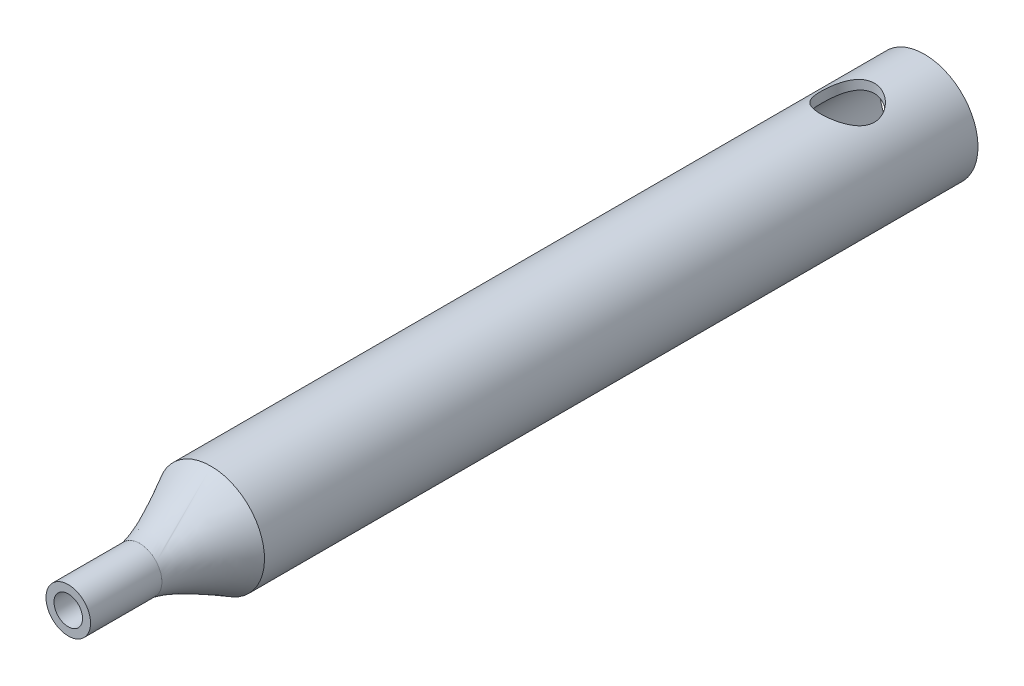
ISO-10303-21;
HEADER;
FILE_DESCRIPTION(('STEP AP214'),'2;1');
FILE_NAME('part.step','',(''),(''),'','','');
FILE_SCHEMA(('AUTOMOTIVE_DESIGN { 1 0 10303 214 1 1 1 1 }'));
ENDSEC;
DATA;
#1=APPLICATION_CONTEXT('core data for automotive mechanical design processes');
#2=APPLICATION_PROTOCOL_DEFINITION('international standard','automotive_design',2000,#1);
#3=PRODUCT_CONTEXT('',#1,'mechanical');
#4=PRODUCT('Part','Part','',(#3));
#5=PRODUCT_RELATED_PRODUCT_CATEGORY('part','',(#4));
#6=PRODUCT_DEFINITION_FORMATION('','',#4);
#7=PRODUCT_DEFINITION_CONTEXT('part definition',#1,'design');
#8=PRODUCT_DEFINITION('design','',#6,#7);
#9=PRODUCT_DEFINITION_SHAPE('','',#8);
#10=(LENGTH_UNIT() NAMED_UNIT(*) SI_UNIT(.MILLI.,.METRE.));
#11=(NAMED_UNIT(*) PLANE_ANGLE_UNIT() SI_UNIT($,.RADIAN.));
#12=(NAMED_UNIT(*) SI_UNIT($,.STERADIAN.) SOLID_ANGLE_UNIT());
#13=UNCERTAINTY_MEASURE_WITH_UNIT(LENGTH_MEASURE(1.E-05),#10,'distance_accuracy_value','');
#14=(GEOMETRIC_REPRESENTATION_CONTEXT(3) GLOBAL_UNCERTAINTY_ASSIGNED_CONTEXT((#13)) GLOBAL_UNIT_ASSIGNED_CONTEXT((#10,
#11,#12)) REPRESENTATION_CONTEXT('',''));
#15=CARTESIAN_POINT('',(0.,0.,0.));
#16=DIRECTION('',(0.,0.,1.));
#17=DIRECTION('',(1.,0.,0.));
#18=AXIS2_PLACEMENT_3D('',#15,#16,#17);
#19=CARTESIAN_POINT('',(0.,0.,400.));
#20=DIRECTION('',(0.,0.,-1.));
#21=DIRECTION('',(-1.,0.,0.));
#22=AXIS2_PLACEMENT_3D('',#19,#20,#21);
#23=CYLINDRICAL_SURFACE('',#22,30.);
#24=CARTESIAN_POINT('',(0.,0.,400.));
#25=DIRECTION('',(0.,0.,-1.));
#26=DIRECTION('',(-1.,0.,0.));
#27=AXIS2_PLACEMENT_3D('',#24,#25,#26);
#28=CIRCLE('',#27,30.);
#29=CARTESIAN_POINT('',(0.2073434643667,29.9992834695728,400.));
#30=VERTEX_POINT('',#29);
#31=EDGE_CURVE('E11',#30,#30,#28,.F.);
#32=ORIENTED_EDGE('',*,*,#31,.F.);
#33=EDGE_LOOP('',(#32));
#34=FACE_BOUND('',#33,.T.);
#35=CARTESIAN_POINT('',(0.,0.,0.));
#36=DIRECTION('',(0.,0.,1.));
#37=DIRECTION('',(1.,0.,0.));
#38=AXIS2_PLACEMENT_3D('',#35,#36,#37);
#39=CIRCLE('',#38,30.);
#40=CARTESIAN_POINT('',(30.,0.,0.));
#41=VERTEX_POINT('',#40);
#42=EDGE_CURVE('E55',#41,#41,#39,.T.);
#43=ORIENTED_EDGE('',*,*,#42,.T.);
#44=EDGE_LOOP('',(#43));
#45=FACE_BOUND('',#44,.T.);
#46=CARTESIAN_POINT('',(0.,30.,28.1148457236322));
#47=CARTESIAN_POINT('',(-0.394466621474774,29.999998801557,28.1148470268429));
#48=CARTESIAN_POINT('',(-0.788960822893599,29.9922016255587,28.1304239945336));
#49=CARTESIAN_POINT('',(-1.57504384672489,29.9612093031255,28.192554460937));
#50=CARTESIAN_POINT('',(-1.96663133023565,29.9380074580889,28.239121435436));
#51=CARTESIAN_POINT('',(-2.74444839066597,29.8767543344875,28.3627835892302));
#52=CARTESIAN_POINT('',(-3.13066783309048,29.8386781124095,28.4399300518542));
#53=CARTESIAN_POINT('',(-3.89427274204148,29.7486545172118,28.6238530448277));
#54=CARTESIAN_POINT('',(-4.27165908796738,29.6967085313725,28.7306266118593));
#55=CARTESIAN_POINT('',(-5.01370255233915,29.5804545351662,28.97219922689));
#56=CARTESIAN_POINT('',(-5.37840368544458,29.5161956713169,29.1068870248155));
#57=CARTESIAN_POINT('',(-6.09447648128182,29.3766988124944,29.4032622061584));
#58=CARTESIAN_POINT('',(-6.4458478568234,29.3014605811394,29.5649501708907));
#59=CARTESIAN_POINT('',(-7.1332709828304,29.1417386091232,29.9138995783717));
#60=CARTESIAN_POINT('',(-7.4693283295993,29.0572582848678,30.1011515774954));
#61=CARTESIAN_POINT('',(-8.12479620523716,28.8808404069853,30.4999761170425));
#62=CARTESIAN_POINT('',(-8.44420009848105,28.7888999175694,30.711558245867));
#63=CARTESIAN_POINT('',(-9.08356730455507,28.5938305145778,31.1711025687115));
#64=CARTESIAN_POINT('',(-9.40240338911198,28.4903612440417,31.4204890287629));
#65=CARTESIAN_POINT('',(-10.0182110858624,28.279698941058,31.9435134191064));
#66=CARTESIAN_POINT('',(-10.3151814463611,28.172505695949,32.2171527357709));
#67=CARTESIAN_POINT('',(-10.8860835918351,27.9568659465954,32.7874035914222));
#68=CARTESIAN_POINT('',(-11.1600008976787,27.8484187026569,33.0840293463725));
#69=CARTESIAN_POINT('',(-11.6833254232374,27.6329515274257,33.6987486541397));
#70=CARTESIAN_POINT('',(-11.9327280363632,27.5259318676454,34.0168462228843));
#71=CARTESIAN_POINT('',(-12.424066666325,27.3078803121426,34.6986355322757));
#72=CARTESIAN_POINT('',(-12.6639084928373,27.1971850469137,35.0639487923506));
#73=CARTESIAN_POINT('',(-13.1116371457317,26.98418857013,35.8157834668044));
#74=CARTESIAN_POINT('',(-13.319537514021,26.8818838099586,36.2022957987823));
#75=CARTESIAN_POINT('',(-13.7015816677248,26.6891822439467,36.9943945283428));
#76=CARTESIAN_POINT('',(-13.8757356708104,26.5987818363898,37.3999751061103));
#77=CARTESIAN_POINT('',(-14.1884178363296,26.4333149346089,38.2276746537374));
#78=CARTESIAN_POINT('',(-14.3269499463523,26.3582467414714,38.6497917850501));
#79=CARTESIAN_POINT('',(-14.5593818816456,26.2305343638818,39.4817182839713));
#80=CARTESIAN_POINT('',(-14.6554546162323,26.1768180083281,39.8907551067101));
#81=CARTESIAN_POINT('',(-14.8131483158836,26.0879066274182,40.717420421028));
#82=CARTESIAN_POINT('',(-14.874770754679,26.0527108097854,41.1350485442918));
#83=CARTESIAN_POINT('',(-14.9625716596024,26.0023849794443,41.9748676257909));
#84=CARTESIAN_POINT('',(-14.9887801055065,25.9872379945846,42.3970544192563));
#85=CARTESIAN_POINT('',(-15.0054120092055,25.9776389850629,43.2423494757854));
#86=CARTESIAN_POINT('',(-14.9958388811994,25.9831849859217,43.665457647083));
#87=CARTESIAN_POINT('',(-14.9443693637688,26.0128145300121,44.4580317685648));
#88=CARTESIAN_POINT('',(-14.9064815133301,26.0345983573782,44.8278532203756));
#89=CARTESIAN_POINT('',(-14.8036048078167,26.0932327004698,45.562459670151));
#90=CARTESIAN_POINT('',(-14.7386184959446,26.1300818023065,45.9272451374268));
#91=CARTESIAN_POINT('',(-14.5822778462236,26.2176501225825,46.6494958378915));
#92=CARTESIAN_POINT('',(-14.490916902454,26.2683728157028,47.0069592131016));
#93=CARTESIAN_POINT('',(-14.2827793732036,26.3821200845655,47.7123966938563));
#94=CARTESIAN_POINT('',(-14.1660014339124,26.4451453155715,48.0603702928263));
#95=CARTESIAN_POINT('',(-13.9051185945145,26.5832643427316,48.7529071091675));
#96=CARTESIAN_POINT('',(-13.7604466030275,26.6586025203762,49.0972075028954));
#97=CARTESIAN_POINT('',(-13.4467240006948,26.8182136501968,49.7724945365024));
#98=CARTESIAN_POINT('',(-13.2776646708395,26.902489795027,50.1034763603415));
#99=CARTESIAN_POINT('',(-12.9163207460711,27.0778318787809,50.7506852648304));
#100=CARTESIAN_POINT('',(-12.7240325037789,27.1688988831368,51.0669100175058));
#101=CARTESIAN_POINT('',(-12.3173373374606,27.3556808628563,51.6833684797858));
#102=CARTESIAN_POINT('',(-12.1029286391493,27.4513962107378,51.9836009037097));
#103=CARTESIAN_POINT('',(-11.6244221009995,27.6577118454254,52.6040592846877));
#104=CARTESIAN_POINT('',(-11.357472454083,27.7686577108201,52.9219759117663));
#105=CARTESIAN_POINT('',(-10.7983337273758,27.9908280513488,53.5344367839275));
#106=CARTESIAN_POINT('',(-10.5061534517949,28.1020524162508,53.8289891136798));
#107=CARTESIAN_POINT('',(-9.89761910582898,28.3221096552123,54.3935663017789));
#108=CARTESIAN_POINT('',(-9.58124396820907,28.4309403363792,54.6635693260845));
#109=CARTESIAN_POINT('',(-8.92619254193719,28.6433515457476,55.1770262515108));
#110=CARTESIAN_POINT('',(-8.58752523371367,28.7469341587371,55.4204907399945));
#111=CARTESIAN_POINT('',(-7.87309152384946,28.9509720492018,55.8900395211003));
#112=CARTESIAN_POINT('',(-7.49633062281164,29.0510540383704,56.1147769925092));
#113=CARTESIAN_POINT('',(-6.72229496746224,29.2398602306793,56.5313995790577));
#114=CARTESIAN_POINT('',(-6.32501925897373,29.3285839048568,56.7232831643152));
#115=CARTESIAN_POINT('',(-5.51289034160744,29.4920238478019,57.0720371782021));
#116=CARTESIAN_POINT('',(-5.09804850978522,29.5667490178724,57.2289298688538));
#117=CARTESIAN_POINT('',(-4.25373396764104,29.6999715301343,57.5059218921032));
#118=CARTESIAN_POINT('',(-3.82426294674312,29.7584707390643,57.6260254573236));
#119=CARTESIAN_POINT('',(-2.99040123124789,29.8532869753576,57.8194445154115));
#120=CARTESIAN_POINT('',(-2.58687987737183,29.8910400620817,57.8958115883602));
#121=CARTESIAN_POINT('',(-1.77375891598894,29.9502903820135,58.0152684604805));
#122=CARTESIAN_POINT('',(-1.36415964033065,29.9717884994209,58.0583600696954));
#123=CARTESIAN_POINT('',(-0.542432179601612,29.997911413823,58.1106852059221));
#124=CARTESIAN_POINT('',(-0.130305071717028,30.0025429572167,58.1199322702964));
#125=CARTESIAN_POINT('',(0.693142933067784,29.994817097575,58.104478938015));
#126=CARTESIAN_POINT('',(1.10446386484085,29.9824604464011,58.0797800437355));
#127=CARTESIAN_POINT('',(1.89104365716467,29.9427257003129,58.0000026454495));
#128=CARTESIAN_POINT('',(2.26662317638415,29.9165882159642,57.9474314160769));
#129=CARTESIAN_POINT('',(3.01155508953995,29.8508011715185,57.8142906791921));
#130=CARTESIAN_POINT('',(3.38090788254089,29.8111524808224,57.7337229731533));
#131=CARTESIAN_POINT('',(4.11102643115709,29.7192676443939,57.545424927818));
#132=CARTESIAN_POINT('',(4.47179170797617,29.6670307986078,57.4376930778512));
#133=CARTESIAN_POINT('',(5.18257720416892,29.5511518897374,57.1961030183818));
#134=CARTESIAN_POINT('',(5.53259697135358,29.4875093474508,57.0622437111314));
#135=CARTESIAN_POINT('',(6.22979935488013,29.3482462177938,56.7653850958304));
#136=CARTESIAN_POINT('',(6.57661612017299,29.272335697607,56.6016633753395));
#137=CARTESIAN_POINT('',(7.25508680349726,29.1116003998498,56.2491473991004));
#138=CARTESIAN_POINT('',(7.5867405882688,29.0267755439573,56.0603529230571));
#139=CARTESIAN_POINT('',(8.23341158684488,28.8500141492428,55.6589988822308));
#140=CARTESIAN_POINT('',(8.54842613296241,28.7580764758464,55.4464355236254));
#141=CARTESIAN_POINT('',(9.16054648853284,28.5689877148343,54.9987940908105));
#142=CARTESIAN_POINT('',(9.45764526147814,28.4718346067851,54.7637072630389));
#143=CARTESIAN_POINT('',(10.060839107335,28.264658535799,54.2482172249215));
#144=CARTESIAN_POINT('',(10.3649587307601,28.1543078560172,53.9656308422517));
#145=CARTESIAN_POINT('',(10.9485707923032,27.9325307005895,53.3764612091946));
#146=CARTESIAN_POINT('',(11.2280621358616,27.8211041773737,53.0698768934048));
#147=CARTESIAN_POINT('',(11.761157874002,27.5999727101685,52.4340399180621));
#148=CARTESIAN_POINT('',(12.0147464980315,27.4902688489899,52.104773650727));
#149=CARTESIAN_POINT('',(12.4944228999317,27.2756020510062,51.4252245980899));
#150=CARTESIAN_POINT('',(12.7205059505332,27.1706399310878,51.0749382155517));
#151=CARTESIAN_POINT('',(13.1539172060939,26.9635854627915,50.33746178314));
#152=CARTESIAN_POINT('',(13.3597919511091,26.8618830625115,49.9493050322685));
#153=CARTESIAN_POINT('',(13.737567232961,26.6706596125161,49.1541242296155));
#154=CARTESIAN_POINT('',(13.9094843147169,26.5811326373223,48.7471094857962));
#155=CARTESIAN_POINT('',(14.2174151642657,26.4177119317274,47.917021374547));
#156=CARTESIAN_POINT('',(14.353457663537,26.343805700354,47.493961170254));
#157=CARTESIAN_POINT('',(14.5879514095295,26.2146840125195,46.6347707815674));
#158=CARTESIAN_POINT('',(14.6864084766722,26.1594656622327,46.198642632146));
#159=CARTESIAN_POINT('',(14.8366134509912,26.0745391304287,45.3595585560246));
#160=CARTESIAN_POINT('',(14.8919378625023,26.0428909694122,44.9574370989508));
#161=CARTESIAN_POINT('',(14.9698153891526,25.9982052216003,44.1490047273543));
#162=CARTESIAN_POINT('',(14.9923707330054,25.9851663691362,43.7426940996416));
#163=CARTESIAN_POINT('',(15.0043645010929,25.9782426346808,42.9295753721242));
#164=CARTESIAN_POINT('',(14.9938151743778,25.9843506681547,42.5227675119811));
#165=CARTESIAN_POINT('',(14.9397884815991,26.0154509876885,41.7120875589525));
#166=CARTESIAN_POINT('',(14.8963124635393,26.0404425006674,41.3082153465664));
#167=CARTESIAN_POINT('',(14.782795841076,26.1050327210138,40.5451740411916));
#168=CARTESIAN_POINT('',(14.7156934571528,26.1430058498993,40.185423678914));
#169=CARTESIAN_POINT('',(14.5558242789108,26.2323533322958,39.4732519078369));
#170=CARTESIAN_POINT('',(14.4630489945772,26.2837321187293,39.1208329650582));
#171=CARTESIAN_POINT('',(14.2527724980854,26.398348288616,38.4254492436286));
#172=CARTESIAN_POINT('',(14.1352709916016,26.4615858132274,38.0824845775704));
#173=CARTESIAN_POINT('',(13.8765585244577,26.5981673635335,37.4076814068152));
#174=CARTESIAN_POINT('',(13.7353452308956,26.6715123835342,37.0758440007397));
#175=CARTESIAN_POINT('',(13.4200195538922,26.8316304555799,36.4028966664141));
#176=CARTESIAN_POINT('',(13.2443351386714,26.9189743770845,36.0626593862493));
#177=CARTESIAN_POINT('',(12.8684192321828,27.1006892572676,35.3980084247445));
#178=CARTESIAN_POINT('',(12.6681869929773,27.195060430022,35.0735952259631));
#179=CARTESIAN_POINT('',(12.2442855818538,27.3885333524453,34.441769724755));
#180=CARTESIAN_POINT('',(12.0206075892618,27.4876368748118,34.1343638877058));
#181=CARTESIAN_POINT('',(11.5509819278367,27.6882651807261,33.5378447656913));
#182=CARTESIAN_POINT('',(11.3050309237573,27.7897903252146,33.2487342313826));
#183=CARTESIAN_POINT('',(10.7607009160988,28.0054119834236,32.6559576192445));
#184=CARTESIAN_POINT('',(10.4595848725634,28.1195336241787,32.3548073137436));
#185=CARTESIAN_POINT('',(9.83237263592984,28.3449371560153,31.7788107156571));
#186=CARTESIAN_POINT('',(9.50628425805798,28.4562199211215,31.5039562537241));
#187=CARTESIAN_POINT('',(8.8304006449509,28.673159445471,30.981978396187));
#188=CARTESIAN_POINT('',(8.48058689086185,28.778811692232,30.7348770723123));
#189=CARTESIAN_POINT('',(7.75934315416604,28.9815957867285,30.2705270285275));
#190=CARTESIAN_POINT('',(7.38791441884538,29.0787281252935,30.0532765885076));
#191=CARTESIAN_POINT('',(6.62283359834587,29.2625004136629,29.6490902817848));
#192=CARTESIAN_POINT('',(6.22904153096555,29.3490603255149,29.4623824161632));
#193=CARTESIAN_POINT('',(5.42422205013372,29.5084068974344,29.1231152844107));
#194=CARTESIAN_POINT('',(5.01319217734312,29.581191583951,28.9705609108149));
#195=CARTESIAN_POINT('',(4.17809175418139,29.7106316368391,28.7018144701986));
#196=CARTESIAN_POINT('',(3.75405665560563,29.7673271650683,28.5855317882122));
#197=CARTESIAN_POINT('',(2.89570983328149,29.8630393092051,28.3904315921045));
#198=CARTESIAN_POINT('',(2.46140455781256,29.9020667236411,28.3115911922829));
#199=CARTESIAN_POINT('',(1.68912528485809,29.9542914994303,28.2064223677277));
#200=CARTESIAN_POINT('',(1.35247752005867,29.9714022130442,28.1721105239883));
#201=CARTESIAN_POINT('',(0.67722664728,29.9942571345872,28.1263213274479));
#202=CARTESIAN_POINT('',(0.338623485589112,30.000001028784,28.1148446049121));
#203=CARTESIAN_POINT('',(0.,30.,28.1148457236322));
#204=B_SPLINE_CURVE_WITH_KNOTS('',3,(#46,#47,#48,#49,#50,#51,#52,#53,#54,#55,#56,#57,#58,#59,
#60,#61,#62,#63,#64,#65,#66,#67,#68,#69,#70,#71,#72,#73,#74,#75,#76,#77,#78,#79,#80,#81,#82,#83,
#84,#85,#86,#87,#88,#89,#90,#91,#92,#93,#94,#95,#96,#97,#98,#99,#100,#101,#102,#103,#104,#105,
#106,#107,#108,#109,#110,#111,#112,#113,#114,#115,#116,#117,#118,#119,#120,#121,#122,#123,#124,
#125,#126,#127,#128,#129,#130,#131,#132,#133,#134,#135,#136,#137,#138,#139,#140,#141,#142,#143,
#144,#145,#146,#147,#148,#149,#150,#151,#152,#153,#154,#155,#156,#157,#158,#159,#160,#161,#162,
#163,#164,#165,#166,#167,#168,#169,#170,#171,#172,#173,#174,#175,#176,#177,#178,#179,#180,#181,
#182,#183,#184,#185,#186,#187,#188,#189,#190,#191,#192,#193,#194,#195,#196,#197,#198,#199,#200,
#201,#202,#203),.UNSPECIFIED.,.T.,.F.,(4,2,2,2,2,2,2,2,2,2,2,2,2,2,2,2,2,2,2,2,2,2,2,2,2,2,2,2,
2,2,2,2,2,2,2,2,2,2,2,2,2,2,2,2,2,2,2,2,2,2,2,2,2,2,2,2,2,2,2,2,2,2,2,2,2,2,2,2,2,2,2,2,2,2,2,2,
2,2,4),(0.,1.1830658838765,2.36664655205927,3.5522205995842,4.73767610811697,5.91849492154762,
7.09933916134023,8.27974835920213,9.46062435602729,10.7126941080732,11.9648354787242,
13.2177575130875,14.4709145374423,15.821667201721,17.1718456109054,18.5216145742371,
19.8712338927467,21.1401798733571,22.4090715662491,23.6768884023223,24.9445842691984,
26.0604534443427,27.1762179182402,28.2922620948529,29.4083657309785,30.5501573825651,
31.6923582661888,32.8347387306653,33.9772108970053,35.2649000045823,36.5521415758273,
37.8405170382692,39.1283766165387,40.4765138704575,41.824713885002,43.1720536807209,
44.519238405488,45.7548292237563,46.9903528264139,48.2253821822107,49.4603568799793,
50.5994583371909,51.7384865108584,52.8775780428886,54.0167174442702,55.188356729037,
56.3600063087792,57.53184316668,58.7041373111916,59.9914055352965,61.2787309408958,
62.5668355046821,63.8551611378706,65.2063513889893,66.5568816778176,67.9063270370394,
69.2555633384069,70.4752824018563,71.6949185050053,72.9141033841498,74.1332383531127,
75.2357784731186,76.3386836391977,77.4416019343193,78.5446288045349,79.7216927437009,
80.8987925552604,82.0763368112874,83.2540576898124,84.5752168212047,85.895964165236,
87.217754555028,88.5394687467831,89.8706389488176,91.2019997209938,92.5300073067729,
93.8572021316087,94.872757858524,95.8883416150965),.UNSPECIFIED.);
#205=CARTESIAN_POINT('',(0.,30.,28.1148457236322));
#206=VERTEX_POINT('',#205);
#207=EDGE_CURVE('E110',#206,#206,#204,.T.);
#208=ORIENTED_EDGE('',*,*,#207,.F.);
#209=EDGE_LOOP('',(#208));
#210=FACE_BOUND('',#209,.T.);
#211=ADVANCED_FACE('F41',(#34,#45,#210),#23,.T.);
#212=CARTESIAN_POINT('',(0.,0.,400.));
#213=DIRECTION('',(0.,0.,-1.));
#214=DIRECTION('',(-1.,0.,0.));
#215=AXIS2_PLACEMENT_3D('',#212,#213,#214);
#216=CYLINDRICAL_SURFACE('',#215,25.);
#217=CARTESIAN_POINT('',(0.,0.,0.));
#218=DIRECTION('',(0.,0.,1.));
#219=DIRECTION('',(1.,0.,0.));
#220=AXIS2_PLACEMENT_3D('',#217,#218,#219);
#221=CIRCLE('',#220,25.);
#222=CARTESIAN_POINT('',(25.,0.,0.));
#223=VERTEX_POINT('',#222);
#224=EDGE_CURVE('E61',#223,#223,#221,.T.);
#225=ORIENTED_EDGE('',*,*,#224,.F.);
#226=EDGE_LOOP('',(#225));
#227=FACE_BOUND('',#226,.T.);
#228=CARTESIAN_POINT('',(0.,0.,400.));
#229=DIRECTION('',(0.,0.,1.));
#230=DIRECTION('',(1.,0.,0.));
#231=AXIS2_PLACEMENT_3D('',#228,#229,#230);
#232=CIRCLE('',#231,25.);
#233=CARTESIAN_POINT('',(15.2480972776865,-19.8114999283298,400.));
#234=VERTEX_POINT('',#233);
#235=EDGE_CURVE('E71',#234,#234,#232,.T.);
#236=ORIENTED_EDGE('',*,*,#235,.T.);
#237=EDGE_LOOP('',(#236));
#238=FACE_BOUND('',#237,.T.);
#239=CARTESIAN_POINT('',(0.,25.,28.1148457236322));
#240=CARTESIAN_POINT('',(-0.383843598201931,24.9999970861597,28.1148488505363));
#241=CARTESIAN_POINT('',(-0.767784254040576,24.991137438834,28.1296022767921));
#242=CARTESIAN_POINT('',(-1.53276887263417,24.9559090750233,28.1884283098888));
#243=CARTESIAN_POINT('',(-1.91381100849754,24.9295301138906,28.2325180715633));
#244=CARTESIAN_POINT('',(-2.67072508911214,24.8598465581404,28.349542283133));
#245=CARTESIAN_POINT('',(-3.0465839447191,24.816505173134,28.4225394353765));
#246=CARTESIAN_POINT('',(-3.78950828651222,24.7139687091223,28.5964032538961));
#247=CARTESIAN_POINT('',(-4.15657496199743,24.6547757876649,28.6972661274363));
#248=CARTESIAN_POINT('',(-4.87779877599095,24.5222523283562,28.9250819516064));
#249=CARTESIAN_POINT('',(-5.23201108142516,24.4489936333394,29.0519025283318));
#250=CARTESIAN_POINT('',(-5.92746529298513,24.2897598083599,29.3305971924712));
#251=CARTESIAN_POINT('',(-6.26870680533959,24.2037842927231,29.4824720397442));
#252=CARTESIAN_POINT('',(-6.93642888935361,24.0209437141628,29.8098032117945));
#253=CARTESIAN_POINT('',(-7.2629157388265,23.9240833448709,29.9852493787731));
#254=CARTESIAN_POINT('',(-7.89998904730598,23.7213395040689,30.3584165247094));
#255=CARTESIAN_POINT('',(-8.21057359815958,23.6154549537696,30.5561401677241));
#256=CARTESIAN_POINT('',(-8.83781905465296,23.3882992480134,30.9884729110151));
#257=CARTESIAN_POINT('',(-9.1531312214518,23.2664706017758,31.2247459717985));
#258=CARTESIAN_POINT('',(-9.7629213752563,23.0172517437796,31.7201230762963));
#259=CARTESIAN_POINT('',(-10.057398454286,22.8898612900329,31.9792281139057));
#260=CARTESIAN_POINT('',(-10.6248831675776,22.6320370342775,32.5193053535624));
#261=CARTESIAN_POINT('',(-10.8978641157463,22.5015997022108,32.8003039006003));
#262=CARTESIAN_POINT('',(-11.4210121902915,22.2406371711999,33.3827479171198));
#263=CARTESIAN_POINT('',(-11.671178827851,22.1101119704335,33.6841938244632));
#264=CARTESIAN_POINT('',(-12.1769914408693,21.8360582425371,34.3447534147307));
#265=CARTESIAN_POINT('',(-12.4295387034086,21.6929009005901,34.70640320681));
#266=CARTESIAN_POINT('',(-12.9030726391603,21.4146251545039,35.4528556834754));
#267=CARTESIAN_POINT('',(-13.1240540998314,21.279508080219,35.8376621771098));
#268=CARTESIAN_POINT('',(-13.5322641506391,21.0222731752269,36.6282834976769));
#269=CARTESIAN_POINT('',(-13.7195368165732,20.9001384563758,37.034069984839));
#270=CARTESIAN_POINT('',(-14.0584554713944,20.6736891809441,37.864992858006));
#271=CARTESIAN_POINT('',(-14.2101147555573,20.5693679781584,38.2901219519986));
#272=CARTESIAN_POINT('',(-14.443430354607,20.4059403493866,39.0521457875738));
#273=CARTESIAN_POINT('',(-14.5331472679521,20.3419988147078,39.3855543539075));
#274=CARTESIAN_POINT('',(-14.6897511158531,20.2292004538863,40.0601699590992));
#275=CARTESIAN_POINT('',(-14.7566431317938,20.1803402704946,40.4013752441445));
#276=CARTESIAN_POINT('',(-14.8666742572357,20.0994197441264,41.0892163931486));
#277=CARTESIAN_POINT('',(-14.9098377634727,20.0673421475889,41.4358463010529));
#278=CARTESIAN_POINT('',(-14.9718816218246,20.0210956696035,42.1324833560694));
#279=CARTESIAN_POINT('',(-14.9907615559489,20.0069270964218,42.4824905612101));
#280=CARTESIAN_POINT('',(-15.0039499265836,19.9970387456714,43.1839216060078));
#281=CARTESIAN_POINT('',(-14.9982099161591,20.0013553430504,43.5353468780422));
#282=CARTESIAN_POINT('',(-14.9621411232559,20.0283506968187,44.2362153793603));
#283=CARTESIAN_POINT('',(-14.9318122213057,20.0510295424255,44.5856585990055));
#284=CARTESIAN_POINT('',(-14.8470086291074,20.1139032813397,45.2802161259529));
#285=CARTESIAN_POINT('',(-14.7925183964389,20.1541094492836,45.6253274994956));
#286=CARTESIAN_POINT('',(-14.6601590013996,20.2505906994963,46.3087301789985));
#287=CARTESIAN_POINT('',(-14.5822892988101,20.3068661530693,46.647021327174));
#288=CARTESIAN_POINT('',(-14.4053154515478,20.4327800596766,47.3104635478657));
#289=CARTESIAN_POINT('',(-14.3065063553846,20.5022315596226,47.6357293389353));
#290=CARTESIAN_POINT('',(-14.0880247918821,20.6529698240816,48.2764515066761));
#291=CARTESIAN_POINT('',(-13.9683455042383,20.7342604561453,48.5919046367696));
#292=CARTESIAN_POINT('',(-13.7091228330125,20.9065578167818,49.2117984936566));
#293=CARTESIAN_POINT('',(-13.5695782545621,20.9975651297165,49.5162385566476));
#294=CARTESIAN_POINT('',(-13.2715474690814,21.1871947948246,50.1132278846028));
#295=CARTESIAN_POINT('',(-13.1130602851057,21.285817539663,50.4057765352361));
#296=CARTESIAN_POINT('',(-12.7486253866408,21.5064058540751,51.0284071529114));
#297=CARTESIAN_POINT('',(-12.5392260080174,21.6294357356237,51.3560960542063));
#298=CARTESIAN_POINT('',(-12.0966278114806,21.8800426177679,51.9930202251659));
#299=CARTESIAN_POINT('',(-11.8634327560062,22.0076188974429,52.3022583999405));
#300=CARTESIAN_POINT('',(-11.3739770929309,22.264525658336,52.9016994003209));
#301=CARTESIAN_POINT('',(-11.1176939142337,22.3938577488344,53.1918831084818));
#302=CARTESIAN_POINT('',(-10.5831847951293,22.6513624553686,53.7518582383822));
#303=CARTESIAN_POINT('',(-10.3049576243925,22.7795350059429,54.0216485150639));
#304=CARTESIAN_POINT('',(-9.68713352998387,23.0496938210152,54.5758594781597));
#305=CARTESIAN_POINT('',(-9.34439126214339,23.1911109861692,54.8570658298433));
#306=CARTESIAN_POINT('',(-8.63303424111083,23.4652087602107,55.3895399128676));
#307=CARTESIAN_POINT('',(-8.2644167615809,23.5978884456118,55.64080448185));
#308=CARTESIAN_POINT('',(-7.50325185662638,23.8508273067756,56.1110464825741));
#309=CARTESIAN_POINT('',(-7.11071324127699,23.9710910118615,56.3300357008492));
#310=CARTESIAN_POINT('',(-6.30389449388674,24.195788680839,56.7333714661788));
#311=CARTESIAN_POINT('',(-5.88961706850805,24.3002246091541,56.9177223129671));
#312=CARTESIAN_POINT('',(-5.06893197868009,24.4841063656874,57.238856241309));
#313=CARTESIAN_POINT('',(-4.66367129451915,24.564711665597,57.3779035839603));
#314=CARTESIAN_POINT('',(-3.83961804513013,24.7069238908804,57.6214606179495));
#315=CARTESIAN_POINT('',(-3.42082586865653,24.7685313615191,57.7259713005454));
#316=CARTESIAN_POINT('',(-2.573734229538,24.8708204616488,57.8987069543663));
#317=CARTESIAN_POINT('',(-2.14544468851985,24.9115229464216,57.9669680912674));
#318=CARTESIAN_POINT('',(-1.28306575999734,24.9707917165063,58.0661680583382));
#319=CARTESIAN_POINT('',(-0.848977196916332,24.9893611152255,58.0971121378149));
#320=CARTESIAN_POINT('',(-0.038557159901996,25.0027956625433,58.1195056839899));
#321=CARTESIAN_POINT('',(0.337604459154143,25.0005398661068,58.1157519713316));
#322=CARTESIAN_POINT('',(1.08807434287322,24.9791304005495,58.0800443272745));
#323=CARTESIAN_POINT('',(1.46238280559599,24.9599785782216,58.0480934779182));
#324=CARTESIAN_POINT('',(2.20633983442916,24.9052445158509,57.9564275104621));
#325=CARTESIAN_POINT('',(2.57598854049865,24.8696627705063,57.8967132283072));
#326=CARTESIAN_POINT('',(3.30803230029226,24.7829131822675,57.7502911272702));
#327=CARTESIAN_POINT('',(3.67042717367751,24.7317449523865,57.6635826381651));
#328=CARTESIAN_POINT('',(4.37685523301615,24.616419378412,57.466650795785));
#329=CARTESIAN_POINT('',(4.72112071492132,24.5526100445156,57.3570539249897));
#330=CARTESIAN_POINT('',(5.39860860100539,24.4125926873419,57.1142925476446));
#331=CARTESIAN_POINT('',(5.73183134124647,24.3363850417986,56.9811287590869));
#332=CARTESIAN_POINT('',(6.38567322040939,24.1730581959947,56.6924341937696));
#333=CARTESIAN_POINT('',(6.70629164180511,24.0859383757151,56.5369021459931));
#334=CARTESIAN_POINT('',(7.33362517640251,23.9024012053276,56.2046873046993));
#335=CARTESIAN_POINT('',(7.64033861236355,23.8059827379661,56.0280019689489));
#336=CARTESIAN_POINT('',(8.26980517998059,23.5951606294873,55.6353023153606));
#337=CARTESIAN_POINT('',(8.59092272944407,23.4799288054403,55.4171095677272));
#338=CARTESIAN_POINT('',(9.21369198185215,23.2426106694795,54.9578856669367));
#339=CARTESIAN_POINT('',(9.51534255354477,23.1205239599888,54.7168531885379));
#340=CARTESIAN_POINT('',(10.0984876356475,22.8718413348671,54.2130071012508));
#341=CARTESIAN_POINT('',(10.3799603037873,22.7452407484749,53.9501705341543));
#342=CARTESIAN_POINT('',(10.9214919932809,22.490233495056,53.4041068271018));
#343=CARTESIAN_POINT('',(11.1815501111138,22.3618267520915,53.120878827736));
#344=CARTESIAN_POINT('',(11.711842411274,22.0892014122374,52.4968267682514));
#345=CARTESIAN_POINT('',(11.9789793522584,21.9451050516921,52.1533088375537));
#346=CARTESIAN_POINT('',(12.4833594208291,21.6621647753414,51.4428440154141));
#347=CARTESIAN_POINT('',(12.7205977369527,21.523321707436,51.0758933673209));
#348=CARTESIAN_POINT('',(13.1633137600036,21.2554478593413,50.3203113823736));
#349=CARTESIAN_POINT('',(13.3688175501278,21.1264090656337,49.9316982118001));
#350=CARTESIAN_POINT('',(13.7463221620137,20.8827470598031,49.1342387326095));
#351=CARTESIAN_POINT('',(13.9183331635795,20.7681194713009,48.7253986193009));
#352=CARTESIAN_POINT('',(14.1933907541535,20.5807934083521,47.9799890005114));
#353=CARTESIAN_POINT('',(14.3033087605131,20.5043856706989,47.6468750900422));
#354=CARTESIAN_POINT('',(14.5001155308505,20.3656858868337,46.9710670161488));
#355=CARTESIAN_POINT('',(14.5870093260325,20.3033907571952,46.6283749638444));
#356=CARTESIAN_POINT('',(14.7366422105018,20.1950469968589,45.9356247136367));
#357=CARTESIAN_POINT('',(14.7994087863437,20.1489798836817,45.5855753799702));
#358=CARTESIAN_POINT('',(14.9000384338231,20.0746802537378,44.8800144155328));
#359=CARTESIAN_POINT('',(14.9379013600587,20.0464478411006,44.5245027528819));
#360=CARTESIAN_POINT('',(14.9882188418345,20.0088555504116,43.8093111813494));
#361=CARTESIAN_POINT('',(15.000575965109,19.9995680435521,43.4496205477374));
#362=CARTESIAN_POINT('',(14.9993827596147,20.0004629136012,42.730306304954));
#363=CARTESIAN_POINT('',(14.9858323853129,20.0106453247287,42.3706826959015));
#364=CARTESIAN_POINT('',(14.9330399600131,20.0500720623985,41.6542235859616));
#365=CARTESIAN_POINT('',(14.8937856905246,20.0793254544093,41.2973894927597));
#366=CARTESIAN_POINT('',(14.7901958992563,20.1557492567276,40.5893493899461));
#367=CARTESIAN_POINT('',(14.7258602739107,20.2029197410183,40.23814340358));
#368=CARTESIAN_POINT('',(14.5767391025224,20.3107531861942,39.5605322277726));
#369=CARTESIAN_POINT('',(14.4930978422934,20.3706500394351,39.2337507172681));
#370=CARTESIAN_POINT('',(14.3048374038112,20.503289403388,38.5888648067041));
#371=CARTESIAN_POINT('',(14.2002114321044,20.5760360731037,38.2707632546218));
#372=CARTESIAN_POINT('',(13.9709549384207,20.7323817775245,37.6445990663022));
#373=CARTESIAN_POINT('',(13.8463230372323,20.8159815603686,37.3365371239597));
#374=CARTESIAN_POINT('',(13.577991485859,20.9919958236309,36.7314532523131));
#375=CARTESIAN_POINT('',(13.4342910062629,21.0844106874226,36.4344318039486));
#376=CARTESIAN_POINT('',(13.1052044073709,21.2907700846095,35.8074888691056));
#377=CARTESIAN_POINT('',(12.9168055284846,21.4058416967628,35.4795176230742));
#378=CARTESIAN_POINT('',(12.5169261183886,21.642100118335,34.840261991569));
#379=CARTESIAN_POINT('',(12.3054428698542,21.7632876467706,34.5289795770282));
#380=CARTESIAN_POINT('',(11.8602581653327,22.0090654256467,33.923791621405));
#381=CARTESIAN_POINT('',(11.6265414946063,22.1336579640345,33.6298982062746));
#382=CARTESIAN_POINT('',(11.1379037923633,22.3835300736241,33.0606010678569));
#383=CARTESIAN_POINT('',(10.8829814131332,22.5088096880192,32.7851985217567));
#384=CARTESIAN_POINT('',(10.3093956231846,22.7778929374613,32.2103949980804));
#385=CARTESIAN_POINT('',(9.98712444962473,22.9213771055024,31.9144298704844));
#386=CARTESIAN_POINT('',(9.31630351045608,23.2021274121993,31.350556723638));
#387=CARTESIAN_POINT('',(8.96775055984757,23.3393927939842,31.082652114376));
#388=CARTESIAN_POINT('',(8.24572196159848,23.6041516372397,30.5768060459735));
#389=CARTESIAN_POINT('',(7.87223408279992,23.7316402361083,30.3388794594251));
#390=CARTESIAN_POINT('',(7.10241008285,23.9732864709495,29.8954271642669));
#391=CARTESIAN_POINT('',(6.7060768311224,24.0874457756816,29.6898973986106));
#392=CARTESIAN_POINT('',(5.90535485537675,24.2959393450001,29.3193609420573));
#393=CARTESIAN_POINT('',(5.50158081631707,24.3907721979159,29.1533092275007));
#394=CARTESIAN_POINT('',(4.67750151978478,24.5621264167291,28.8560653756812));
#395=CARTESIAN_POINT('',(4.25719351622463,24.638644725728,28.7248790574331));
#396=CARTESIAN_POINT('',(3.40501595177152,24.7707728782358,28.4998033733401));
#397=CARTESIAN_POINT('',(2.97318944063261,24.8264513407411,28.4057915449188));
#398=CARTESIAN_POINT('',(2.10091679412847,24.9154168023929,28.2561227402211));
#399=CARTESIAN_POINT('',(1.66047815319875,24.9487224499678,28.200433819675));
#400=CARTESIAN_POINT('',(1.01562005124393,24.9801864376456,28.14788729234));
#401=CARTESIAN_POINT('',(0.812782174910464,24.9876101393964,28.1355032830096));
#402=CARTESIAN_POINT('',(0.406638621564437,24.9975177780224,28.1189815274251));
#403=CARTESIAN_POINT('',(0.20333292856946,25.0000015435445,28.1148440672217));
#404=CARTESIAN_POINT('',(0.,25.,28.1148457236322));
#405=B_SPLINE_CURVE_WITH_KNOTS('',3,(#239,#240,#241,#242,#243,#244,#245,#246,#247,#248,#249,
#250,#251,#252,#253,#254,#255,#256,#257,#258,#259,#260,#261,#262,#263,#264,#265,#266,#267,#268,
#269,#270,#271,#272,#273,#274,#275,#276,#277,#278,#279,#280,#281,#282,#283,#284,#285,#286,#287,
#288,#289,#290,#291,#292,#293,#294,#295,#296,#297,#298,#299,#300,#301,#302,#303,#304,#305,#306,
#307,#308,#309,#310,#311,#312,#313,#314,#315,#316,#317,#318,#319,#320,#321,#322,#323,#324,#325,
#326,#327,#328,#329,#330,#331,#332,#333,#334,#335,#336,#337,#338,#339,#340,#341,#342,#343,#344,
#345,#346,#347,#348,#349,#350,#351,#352,#353,#354,#355,#356,#357,#358,#359,#360,#361,#362,#363,
#364,#365,#366,#367,#368,#369,#370,#371,#372,#373,#374,#375,#376,#377,#378,#379,#380,#381,#382,
#383,#384,#385,#386,#387,#388,#389,#390,#391,#392,#393,#394,#395,#396,#397,#398,#399,#400,#401,
#402,#403,#404),.UNSPECIFIED.,.T.,.F.,(4,2,2,2,2,2,2,2,2,2,2,2,2,2,2,2,2,2,2,2,2,2,2,2,2,2,2,2,
2,2,2,2,2,2,2,2,2,2,2,2,2,2,2,2,2,2,2,2,2,2,2,2,2,2,2,2,2,2,2,2,2,2,2,2,2,2,2,2,2,2,2,2,2,2,2,2,
2,2,2,2,2,2,4),(0.,1.15131650286521,2.30330684658597,3.45780975393181,4.612155602032,
5.76075519873301,6.90938963716679,8.05753066262214,9.20580913480962,10.4418189333315,
11.677882563005,12.9154572581261,14.1530584631589,15.5426172518037,16.9324052372309,
18.3203625971641,19.7078009747203,20.7601695949573,21.8123037789111,22.8633541662871,
23.9144226450402,24.9675603560417,26.0207031840108,27.0745244592484,28.1283700865276,
29.1682513024588,30.2084729869153,31.2487572656591,32.2890952191643,33.5115258926161,
34.7337635807986,35.9572093784948,37.1807238197138,38.5750211979187,39.9694657072174,
41.3633997151926,42.757160576736,44.063161425012,45.3691247856981,46.6737827450107,
47.9782571595934,49.1054114040663,50.2324424620235,51.3594395877587,52.4864646972628,
53.5859458393993,54.6853934903978,55.7849036392925,56.8845460618251,58.0982352119811,
59.3119948278363,60.5270490774492,61.7421545662941,63.1157547067805,64.4895756135914,
65.8622612715279,67.2345290616493,68.310502748735,69.3862411219535,70.4607503192203,
71.5352657900453,72.6138783741586,73.6924928539611,74.7716204317745,75.8507524655585,
76.8775008650291,77.9045821954032,78.9317343633339,79.9589312231551,81.143836327243,
82.3288810604908,83.5147426565242,84.7006796768088,86.080471860688,87.4604315264943,
88.8410731397027,90.2215417178829,91.5598929838274,92.8984674797594,94.2325948699265,
95.5656088394694,96.1754729545425,96.785358223789),.UNSPECIFIED.);
#406=CARTESIAN_POINT('',(0.,25.,28.1148457236322));
#407=VERTEX_POINT('',#406);
#408=EDGE_CURVE('E45',#407,#407,#405,.T.);
#409=ORIENTED_EDGE('',*,*,#408,.T.);
#410=EDGE_LOOP('',(#409));
#411=FACE_BOUND('',#410,.T.);
#412=ADVANCED_FACE('F77',(#227,#238,#411),#216,.F.);
#413=CARTESIAN_POINT('',(0.,0.,0.));
#414=DIRECTION('',(0.,0.,1.));
#415=DIRECTION('',(1.,0.,0.));
#416=AXIS2_PLACEMENT_3D('',#413,#414,#415);
#417=PLANE('',#416);
#418=ORIENTED_EDGE('',*,*,#42,.F.);
#419=EDGE_LOOP('',(#418));
#420=FACE_BOUND('',#419,.T.);
#421=ORIENTED_EDGE('',*,*,#224,.T.);
#422=EDGE_LOOP('',(#421));
#423=FACE_BOUND('',#422,.T.);
#424=ADVANCED_FACE('F86',(#420,#423),#417,.F.);
#425=CARTESIAN_POINT('',(0.2073434643667,29.9992834695728,400.));
#426=CARTESIAN_POINT('',(9.38158045045876,8.2605053266474,440.));
#427=CARTESIAN_POINT('',(-59.7912234747789,30.4139703983062,400.));
#428=CARTESIAN_POINT('',(-7.13943020283603,27.0236662275649,440.));
#429=CARTESIAN_POINT('',(-60.2059104035123,-29.5845965408394,400.));
#430=CARTESIAN_POINT('',(-25.9025911037536,10.5026555742701,440.));
#431=CARTESIAN_POINT('',(-0.207343464366697,-29.9992834695728,400.));
#432=CARTESIAN_POINT('',(-9.38158045045876,-8.2605053266474,440.));
#433=CARTESIAN_POINT('',(59.7912234747789,-30.4139703983062,400.));
#434=CARTESIAN_POINT('',(7.13943020283603,-27.0236662275649,440.));
#435=CARTESIAN_POINT('',(60.2059104035123,29.5845965408394,400.));
#436=CARTESIAN_POINT('',(25.9025911037536,-10.5026555742701,440.));
#437=CARTESIAN_POINT('',(0.2073434643667,29.9992834695728,400.));
#438=CARTESIAN_POINT('',(9.38158045045876,8.2605053266474,440.));
#439=(BOUNDED_SURFACE() B_SPLINE_SURFACE(3,1,((#425,#426),(#427,#428),(#429,#430),(#431,#432),
(#433,#434),(#435,#436),(#437,#438)),.UNSPECIFIED.,.T.,.F.,.F.) B_SPLINE_SURFACE_WITH_KNOTS((4,
3,4),(2,2),(0.,0.5,1.),(0.,1.),
.UNSPECIFIED.) GEOMETRIC_REPRESENTATION_ITEM() RATIONAL_B_SPLINE_SURFACE(((1.,1.),
(0.333333333333333,0.333333333333333),(0.333333333333333,0.333333333333333),(1.,1.),
(0.333333333333333,0.333333333333333),(0.333333333333333,0.333333333333333),(1.,1.))) REPRESENTATION_ITEM('') SURFACE());
#440=CARTESIAN_POINT('',(0.,0.,440.));
#441=DIRECTION('',(0.,0.,1.));
#442=DIRECTION('',(1.,0.,0.));
#443=AXIS2_PLACEMENT_3D('',#440,#441,#442);
#444=CIRCLE('',#443,12.5);
#445=CARTESIAN_POINT('',(9.38158045045876,8.2605053266474,440.));
#446=VERTEX_POINT('',#445);
#447=EDGE_CURVE('E150',#446,#446,#444,.T.);
#448=CARTESIAN_POINT('',(0.2073434643667,29.9992834695728,400.));
#449=CARTESIAN_POINT('',(0.302908432971828,29.7728378639173,400.416666666667));
#450=CARTESIAN_POINT('',(0.398473401576953,29.5463922582619,400.833333333333));
#451=CARTESIAN_POINT('',(0.589603338787203,29.0935010469509,401.666666666667));
#452=CARTESIAN_POINT('',(0.685168307392328,28.8670554412954,402.083333333333));
#453=CARTESIAN_POINT('',(0.876298244602579,28.4141642299845,402.916666666667));
#454=CARTESIAN_POINT('',(0.971863213207703,28.187718624329,403.333333333333));
#455=CARTESIAN_POINT('',(1.16299315041795,27.7348274130181,404.166666666667));
#456=CARTESIAN_POINT('',(1.25855811902308,27.5083818073626,404.583333333333));
#457=CARTESIAN_POINT('',(1.44968805623333,27.0554905960517,405.416666666667));
#458=CARTESIAN_POINT('',(1.54525302483846,26.8290449903962,405.833333333333));
#459=CARTESIAN_POINT('',(1.73638296204871,26.3761537790852,406.666666666667));
#460=CARTESIAN_POINT('',(1.83194793065383,26.1497081734298,407.083333333333));
#461=CARTESIAN_POINT('',(2.02307786786409,25.6968169621188,407.916666666667));
#462=CARTESIAN_POINT('',(2.11864283646921,25.4703713564633,408.333333333333));
#463=CARTESIAN_POINT('',(2.30977277367947,25.0174801451524,409.166666666667));
#464=CARTESIAN_POINT('',(2.40533774228459,24.7910345394969,409.583333333333));
#465=CARTESIAN_POINT('',(2.59646767949484,24.338143328186,410.416666666667));
#466=CARTESIAN_POINT('',(2.69203264809997,24.1116977225305,410.833333333333));
#467=CARTESIAN_POINT('',(2.88316258531022,23.6588065112196,411.666666666667));
#468=CARTESIAN_POINT('',(2.97872755391534,23.4323609055641,412.083333333333));
#469=CARTESIAN_POINT('',(3.16985749112559,22.9794696942531,412.916666666667));
#470=CARTESIAN_POINT('',(3.26542245973072,22.7530240885977,413.333333333333));
#471=CARTESIAN_POINT('',(3.45655239694097,22.3001328772867,414.166666666667));
#472=CARTESIAN_POINT('',(3.5521173655461,22.0736872716313,414.583333333333));
#473=CARTESIAN_POINT('',(3.74324730275635,21.6207960603203,415.416666666667));
#474=CARTESIAN_POINT('',(3.83881227136147,21.3943504546648,415.833333333333));
#475=CARTESIAN_POINT('',(4.02994220857173,20.9414592433539,416.666666666667));
#476=CARTESIAN_POINT('',(4.12550717717685,20.7150136376984,417.083333333333));
#477=CARTESIAN_POINT('',(4.3166371143871,20.2621224263875,417.916666666667));
#478=CARTESIAN_POINT('',(4.41220208299223,20.035676820732,418.333333333333));
#479=CARTESIAN_POINT('',(4.60333202020248,19.582785609421,419.166666666667));
#480=CARTESIAN_POINT('',(4.6988969888076,19.3563400037656,419.583333333333));
#481=CARTESIAN_POINT('',(4.89002692601786,18.9034487924546,420.416666666667));
#482=CARTESIAN_POINT('',(4.98559189462298,18.6770031867992,420.833333333333));
#483=CARTESIAN_POINT('',(5.17672183183323,18.2241119754882,421.666666666667));
#484=CARTESIAN_POINT('',(5.27228680043836,17.9976663698327,422.083333333333));
#485=CARTESIAN_POINT('',(5.46341673764861,17.5447751585218,422.916666666667));
#486=CARTESIAN_POINT('',(5.55898170625374,17.3183295528663,423.333333333333));
#487=CARTESIAN_POINT('',(5.75011164346399,16.8654383415554,424.166666666667));
#488=CARTESIAN_POINT('',(5.84567661206911,16.6389927358999,424.583333333333));
#489=CARTESIAN_POINT('',(6.03680654927936,16.186101524589,425.416666666667));
#490=CARTESIAN_POINT('',(6.13237151788449,15.9596559189335,425.833333333333));
#491=CARTESIAN_POINT('',(6.32350145509474,15.5067647076225,426.666666666667));
#492=CARTESIAN_POINT('',(6.41906642369987,15.2803191019671,427.083333333333));
#493=CARTESIAN_POINT('',(6.61019636091012,14.8274278906561,427.916666666667));
#494=CARTESIAN_POINT('',(6.70576132951525,14.6009822850006,428.333333333333));
#495=CARTESIAN_POINT('',(6.8968912667255,14.1480910736897,429.166666666667));
#496=CARTESIAN_POINT('',(6.99245623533062,13.9216454680342,429.583333333333));
#497=CARTESIAN_POINT('',(7.18358617254087,13.4687542567233,430.416666666667));
#498=CARTESIAN_POINT('',(7.279151141146,13.2423086510678,430.833333333333));
#499=CARTESIAN_POINT('',(7.47028107835625,12.7894174397569,431.666666666667));
#500=CARTESIAN_POINT('',(7.56584604696138,12.5629718341014,432.083333333333));
#501=CARTESIAN_POINT('',(7.75697598417163,12.1100806227904,432.916666666667));
#502=CARTESIAN_POINT('',(7.85254095277675,11.883635017135,433.333333333333));
#503=CARTESIAN_POINT('',(8.043670889987,11.430743805824,434.166666666667));
#504=CARTESIAN_POINT('',(8.13923585859213,11.2042982001685,434.583333333333));
#505=CARTESIAN_POINT('',(8.33036579580238,10.7514069888576,435.416666666667));
#506=CARTESIAN_POINT('',(8.4259307644075,10.5249613832021,435.833333333333));
#507=CARTESIAN_POINT('',(8.61706070161775,10.0720701718912,436.666666666667));
#508=CARTESIAN_POINT('',(8.71262567022288,9.8456245662357,437.083333333333));
#509=CARTESIAN_POINT('',(8.90375560743314,9.39273335492476,437.916666666667));
#510=CARTESIAN_POINT('',(8.99932057603826,9.16628774926929,438.333333333333));
#511=CARTESIAN_POINT('',(9.1904505132485,8.71339653795835,439.166666666667));
#512=CARTESIAN_POINT('',(9.28601548185363,8.48695093230288,439.583333333333));
#513=CARTESIAN_POINT('',(9.38158045045876,8.2605053266474,440.));
#514=B_SPLINE_CURVE_WITH_KNOTS('',3,(#448,#449,#450,#451,#452,#453,#454,#455,#456,#457,#458,
#459,#460,#461,#462,#463,#464,#465,#466,#467,#468,#469,#470,#471,#472,#473,#474,#475,#476,#477,
#478,#479,#480,#481,#482,#483,#484,#485,#486,#487,#488,#489,#490,#491,#492,#493,#494,#495,#496,
#497,#498,#499,#500,#501,#502,#503,#504,#505,#506,#507,#508,#509,#510,#511,#512,#513),
.UNSPECIFIED.,.F.,.F.,(4,2,2,2,2,2,2,2,2,2,2,2,2,2,2,2,2,2,2,2,2,2,2,2,2,2,2,2,2,2,2,2,4),(0.,
1.4512727103844,2.90254542076885,4.3538181311533,5.8050908415377,7.2563635519221,
8.70763626230655,10.158908972691,11.6101816830754,13.0614543934598,14.5127271038443,
15.9639998142287,17.4152725246131,18.8665452349975,20.3178179453819,21.7690906557664,
23.2203633661508,24.6716360765352,26.1229087869196,27.574181497304,29.0254542076885,
30.4767269180729,31.9279996284573,33.3792723388417,34.8305450492262,36.2818177596106,
37.733090469995,39.1843631803795,40.6356358907639,42.0869086011483,43.5381813115327,
44.9894540219172,46.4407267323016),.UNSPECIFIED.);
#515=EDGE_CURVE('BSEAM88',#30,#446,#514,.T.);
#516=ORIENTED_EDGE('',*,*,#31,.T.);
#517=ORIENTED_EDGE('',*,*,#447,.F.);
#518=ORIENTED_EDGE('',*,*,#515,.T.);
#519=ORIENTED_EDGE('',*,*,#515,.F.);
#520=EDGE_LOOP('',(#516,#518,#517,#519));
#521=FACE_BOUND('',#520,.T.);
#522=ADVANCED_FACE('F88',(#521),#439,.T.);
#523=CARTESIAN_POINT('',(15.2480972776865,-19.8114999283298,400.));
#524=CARTESIAN_POINT('',(7.9015067247611,-1.25147572032184,440.));
#525=CARTESIAN_POINT('',(54.8710971343461,10.6846946270432,400.));
#526=CARTESIAN_POINT('',(10.4044581654048,14.5515377292004,440.));
#527=CARTESIAN_POINT('',(24.3749025789731,50.3076944837028,400.));
#528=CARTESIAN_POINT('',(-5.39855528411742,17.054489169844,440.));
#529=CARTESIAN_POINT('',(-15.2480972776865,19.8114999283298,400.));
#530=CARTESIAN_POINT('',(-7.9015067247611,1.25147572032184,440.));
#531=CARTESIAN_POINT('',(-54.871097134346,-10.6846946270432,400.));
#532=CARTESIAN_POINT('',(-10.4044581654048,-14.5515377292004,440.));
#533=CARTESIAN_POINT('',(-24.374902578973,-50.3076944837027,400.));
#534=CARTESIAN_POINT('',(5.39855528411742,-17.054489169844,440.));
#535=CARTESIAN_POINT('',(15.2480972776865,-19.8114999283298,400.));
#536=CARTESIAN_POINT('',(7.9015067247611,-1.25147572032184,440.));
#537=(BOUNDED_SURFACE() B_SPLINE_SURFACE(3,1,((#523,#524),(#525,#526),(#527,#528),(#529,#530),
(#531,#532),(#533,#534),(#535,#536)),.UNSPECIFIED.,.T.,.F.,.F.) B_SPLINE_SURFACE_WITH_KNOTS((4,
3,4),(2,2),(0.,0.5,1.),(0.,1.),
.UNSPECIFIED.) GEOMETRIC_REPRESENTATION_ITEM() RATIONAL_B_SPLINE_SURFACE(((1.,1.),
(0.333333333333333,0.333333333333333),(0.333333333333333,0.333333333333333),(1.,1.),
(0.333333333333333,0.333333333333333),(0.333333333333333,0.333333333333333),(1.,1.))) REPRESENTATION_ITEM('') SURFACE());
#538=CARTESIAN_POINT('',(0.,0.,440.));
#539=DIRECTION('',(0.,0.,1.));
#540=DIRECTION('',(1.,0.,0.));
#541=AXIS2_PLACEMENT_3D('',#538,#539,#540);
#542=CIRCLE('',#541,8.);
#543=CARTESIAN_POINT('',(7.9015067247611,-1.25147572032184,440.));
#544=VERTEX_POINT('',#543);
#545=EDGE_CURVE('E113',#544,#544,#542,.T.);
#546=CARTESIAN_POINT('',(15.2480972776865,-19.8114999283298,400.));
#547=CARTESIAN_POINT('',(15.1715702927602,-19.6181663428297,400.416666666667));
#548=CARTESIAN_POINT('',(15.0950433078339,-19.4248327573296,400.833333333333));
#549=CARTESIAN_POINT('',(14.9419893379812,-19.0381655863294,401.666666666667));
#550=CARTESIAN_POINT('',(14.8654623530549,-18.8448320008294,402.083333333333));
#551=CARTESIAN_POINT('',(14.7124083832023,-18.4581648298292,402.916666666667));
#552=CARTESIAN_POINT('',(14.635881398276,-18.2648312443291,403.333333333333));
#553=CARTESIAN_POINT('',(14.4828274284234,-17.8781640733289,404.166666666667));
#554=CARTESIAN_POINT('',(14.4063004434971,-17.6848304878289,404.583333333333));
#555=CARTESIAN_POINT('',(14.2532464736445,-17.2981633168287,405.416666666667));
#556=CARTESIAN_POINT('',(14.1767194887182,-17.1048297313286,405.833333333333));
#557=CARTESIAN_POINT('',(14.0236655188656,-16.7181625603284,406.666666666667));
#558=CARTESIAN_POINT('',(13.9471385339393,-16.5248289748284,407.083333333333));
#559=CARTESIAN_POINT('',(13.7940845640867,-16.1381618038282,407.916666666667));
#560=CARTESIAN_POINT('',(13.7175575791604,-15.9448282183281,408.333333333333));
#561=CARTESIAN_POINT('',(13.5645036093077,-15.5581610473279,409.166666666667));
#562=CARTESIAN_POINT('',(13.4879766243814,-15.3648274618279,409.583333333333));
#563=CARTESIAN_POINT('',(13.3349226545288,-14.9781602908277,410.416666666667));
#564=CARTESIAN_POINT('',(13.2583956696025,-14.7848267053276,410.833333333333));
#565=CARTESIAN_POINT('',(13.1053416997499,-14.3981595343275,411.666666666667));
#566=CARTESIAN_POINT('',(13.0288147148236,-14.2048259488274,412.083333333333));
#567=CARTESIAN_POINT('',(12.875760744971,-13.8181587778272,412.916666666667));
#568=CARTESIAN_POINT('',(12.7992337600447,-13.6248251923271,413.333333333333));
#569=CARTESIAN_POINT('',(12.6461797901921,-13.238158021327,414.166666666667));
#570=CARTESIAN_POINT('',(12.5696528052658,-13.0448244358269,414.583333333333));
#571=CARTESIAN_POINT('',(12.4165988354132,-12.6581572648267,415.416666666667));
#572=CARTESIAN_POINT('',(12.3400718504868,-12.4648236793266,415.833333333333));
#573=CARTESIAN_POINT('',(12.1870178806342,-12.0781565083265,416.666666666667));
#574=CARTESIAN_POINT('',(12.1104908957079,-11.8848229228264,417.083333333333));
#575=CARTESIAN_POINT('',(11.9574369258553,-11.4981557518262,417.916666666667));
#576=CARTESIAN_POINT('',(11.880909940929,-11.3048221663261,418.333333333333));
#577=CARTESIAN_POINT('',(11.7278559710764,-10.918154995326,419.166666666667));
#578=CARTESIAN_POINT('',(11.6513289861501,-10.7248214098259,419.583333333333));
#579=CARTESIAN_POINT('',(11.4982750162975,-10.3381542388257,420.416666666667));
#580=CARTESIAN_POINT('',(11.4217480313712,-10.1448206533256,420.833333333333));
#581=CARTESIAN_POINT('',(11.2686940615186,-9.75815348232548,421.666666666667));
#582=CARTESIAN_POINT('',(11.1921670765923,-9.5648198968254,422.083333333333));
#583=CARTESIAN_POINT('',(11.0391131067396,-9.17815272582523,422.916666666667));
#584=CARTESIAN_POINT('',(10.9625861218133,-8.98481914032514,423.333333333333));
#585=CARTESIAN_POINT('',(10.8095321519607,-8.59815196932497,424.166666666667));
#586=CARTESIAN_POINT('',(10.7330051670344,-8.4048183838249,424.583333333333));
#587=CARTESIAN_POINT('',(10.5799511971818,-8.01815121282474,425.416666666667));
#588=CARTESIAN_POINT('',(10.5034242122555,-7.82481762732465,425.833333333333));
#589=CARTESIAN_POINT('',(10.3503702424029,-7.43815045632448,426.666666666667));
#590=CARTESIAN_POINT('',(10.2738432574766,-7.2448168708244,427.083333333333));
#591=CARTESIAN_POINT('',(10.120789287624,-6.85814969982424,427.916666666667));
#592=CARTESIAN_POINT('',(10.0442623026977,-6.66481611432414,428.333333333333));
#593=CARTESIAN_POINT('',(9.89120833284506,-6.27814894332398,429.166666666667));
#594=CARTESIAN_POINT('',(9.81468134791875,-6.08481535782391,429.583333333333));
#595=CARTESIAN_POINT('',(9.66162737806614,-5.69814818682375,430.416666666667));
#596=CARTESIAN_POINT('',(9.58510039313984,-5.50481460132366,430.833333333333));
#597=CARTESIAN_POINT('',(9.43204642328722,-5.11814743032349,431.666666666667));
#598=CARTESIAN_POINT('',(9.35551943836091,-4.92481384482341,432.083333333333));
#599=CARTESIAN_POINT('',(9.2024654685083,-4.53814667382324,432.916666666667));
#600=CARTESIAN_POINT('',(9.125938483582,-4.34481308832317,433.333333333333));
#601=CARTESIAN_POINT('',(8.97288451372939,-3.958145917323,434.166666666667));
#602=CARTESIAN_POINT('',(8.89635752880308,-3.76481233182291,434.583333333333));
#603=CARTESIAN_POINT('',(8.74330355895047,-3.37814516082275,435.416666666667));
#604=CARTESIAN_POINT('',(8.66677657402416,-3.18481157532267,435.833333333333));
#605=CARTESIAN_POINT('',(8.51372260417155,-2.79814440432251,436.666666666667));
#606=CARTESIAN_POINT('',(8.43719561924524,-2.60481081882242,437.083333333333));
#607=CARTESIAN_POINT('',(8.28414164939263,-2.21814364782225,437.916666666667));
#608=CARTESIAN_POINT('',(8.20761466446633,-2.02481006232217,438.333333333333));
#609=CARTESIAN_POINT('',(8.05456069461372,-1.63814289132201,439.166666666667));
#610=CARTESIAN_POINT('',(7.97803370968741,-1.44480930582194,439.583333333333));
#611=CARTESIAN_POINT('',(7.9015067247611,-1.25147572032184,440.));
#612=B_SPLINE_CURVE_WITH_KNOTS('',3,(#546,#547,#548,#549,#550,#551,#552,#553,#554,#555,#556,
#557,#558,#559,#560,#561,#562,#563,#564,#565,#566,#567,#568,#569,#570,#571,#572,#573,#574,#575,
#576,#577,#578,#579,#580,#581,#582,#583,#584,#585,#586,#587,#588,#589,#590,#591,#592,#593,#594,
#595,#596,#597,#598,#599,#600,#601,#602,#603,#604,#605,#606,#607,#608,#609,#610,#611),
.UNSPECIFIED.,.F.,.F.,(4,2,2,2,2,2,2,2,2,2,2,2,2,2,2,2,2,2,2,2,2,2,2,2,2,2,2,2,2,2,2,2,4),(0.,
1.39699974672081,2.79399949344166,4.19099924016251,5.58799898688332,6.98499873360412,
8.38199848032498,9.77899822704578,11.1759979737666,12.5729977204874,13.9699974672083,
15.3669972139291,16.76399696065,18.1609967073708,19.5579964540916,20.9549962008124,
22.3519959475333,23.7489956942541,25.1459954409749,26.5429951876957,27.9399949344166,
29.3369946811374,30.7339944278582,32.130994174579,33.5279939212999,34.9249936680207,
36.3219934147415,37.7189931614624,39.1159929081832,40.512992654904,41.9099924016248,
43.3069921483457,44.7039918950665),.UNSPECIFIED.);
#613=EDGE_CURVE('BSEAM99',#234,#544,#612,.T.);
#614=ORIENTED_EDGE('',*,*,#235,.F.);
#615=ORIENTED_EDGE('',*,*,#545,.T.);
#616=ORIENTED_EDGE('',*,*,#613,.T.);
#617=ORIENTED_EDGE('',*,*,#613,.F.);
#618=EDGE_LOOP('',(#614,#616,#615,#617));
#619=FACE_BOUND('',#618,.T.);
#620=ADVANCED_FACE('F99',(#619),#537,.F.);
#621=CARTESIAN_POINT('',(0.,0.,480.));
#622=DIRECTION('',(0.,0.,1.));
#623=DIRECTION('',(1.,0.,0.));
#624=AXIS2_PLACEMENT_3D('',#621,#622,#623);
#625=PLANE('',#624);
#626=CARTESIAN_POINT('',(0.,0.,480.));
#627=DIRECTION('',(0.,0.,1.));
#628=DIRECTION('',(1.,0.,0.));
#629=AXIS2_PLACEMENT_3D('',#626,#627,#628);
#630=CIRCLE('',#629,12.5);
#631=CARTESIAN_POINT('',(12.5,0.,480.));
#632=VERTEX_POINT('',#631);
#633=EDGE_CURVE('E170',#632,#632,#630,.T.);
#634=ORIENTED_EDGE('',*,*,#633,.T.);
#635=EDGE_LOOP('',(#634));
#636=FACE_BOUND('',#635,.T.);
#637=CARTESIAN_POINT('',(0.,0.,480.));
#638=DIRECTION('',(0.,0.,1.));
#639=DIRECTION('',(1.,0.,0.));
#640=AXIS2_PLACEMENT_3D('',#637,#638,#639);
#641=CIRCLE('',#640,8.);
#642=CARTESIAN_POINT('',(8.,0.,480.));
#643=VERTEX_POINT('',#642);
#644=EDGE_CURVE('E118',#643,#643,#641,.T.);
#645=ORIENTED_EDGE('',*,*,#644,.F.);
#646=EDGE_LOOP('',(#645));
#647=FACE_BOUND('',#646,.T.);
#648=ADVANCED_FACE('F136',(#636,#647),#625,.T.);
#649=CARTESIAN_POINT('',(0.,0.,480.));
#650=DIRECTION('',(0.,0.,-1.));
#651=DIRECTION('',(-1.,0.,0.));
#652=AXIS2_PLACEMENT_3D('',#649,#650,#651);
#653=CYLINDRICAL_SURFACE('',#652,12.5);
#654=ORIENTED_EDGE('',*,*,#633,.F.);
#655=EDGE_LOOP('',(#654));
#656=FACE_BOUND('',#655,.T.);
#657=ORIENTED_EDGE('',*,*,#447,.T.);
#658=EDGE_LOOP('',(#657));
#659=FACE_BOUND('',#658,.T.);
#660=ADVANCED_FACE('F134',(#656,#659),#653,.T.);
#661=CARTESIAN_POINT('',(0.,0.,480.));
#662=DIRECTION('',(0.,0.,-1.));
#663=DIRECTION('',(-1.,0.,0.));
#664=AXIS2_PLACEMENT_3D('',#661,#662,#663);
#665=CYLINDRICAL_SURFACE('',#664,8.);
#666=ORIENTED_EDGE('',*,*,#644,.T.);
#667=EDGE_LOOP('',(#666));
#668=FACE_BOUND('',#667,.T.);
#669=ORIENTED_EDGE('',*,*,#545,.F.);
#670=EDGE_LOOP('',(#669));
#671=FACE_BOUND('',#670,.T.);
#672=ADVANCED_FACE('F129',(#668,#671),#665,.F.);
#673=CARTESIAN_POINT('',(0.,40.,43.1148457236322));
#674=DIRECTION('',(0.,-1.,0.));
#675=DIRECTION('',(0.,0.,-1.));
#676=AXIS2_PLACEMENT_3D('',#673,#674,#675);
#677=CYLINDRICAL_SURFACE('',#676,15.);
#678=ORIENTED_EDGE('',*,*,#408,.F.);
#679=EDGE_LOOP('',(#678));
#680=FACE_BOUND('',#679,.T.);
#681=ORIENTED_EDGE('',*,*,#207,.T.);
#682=EDGE_LOOP('',(#681));
#683=FACE_BOUND('',#682,.T.);
#684=ADVANCED_FACE('F125',(#680,#683),#677,.F.);
#685=CLOSED_SHELL('',(#211,#412,#424,#522,#620,#648,#660,#672,#684));
#686=MANIFOLD_SOLID_BREP('B2',#685);
#687=ADVANCED_BREP_SHAPE_REPRESENTATION('',(#18,#686),#14);
#688=SHAPE_DEFINITION_REPRESENTATION(#9,#687);
ENDSEC;
END-ISO-10303-21;
